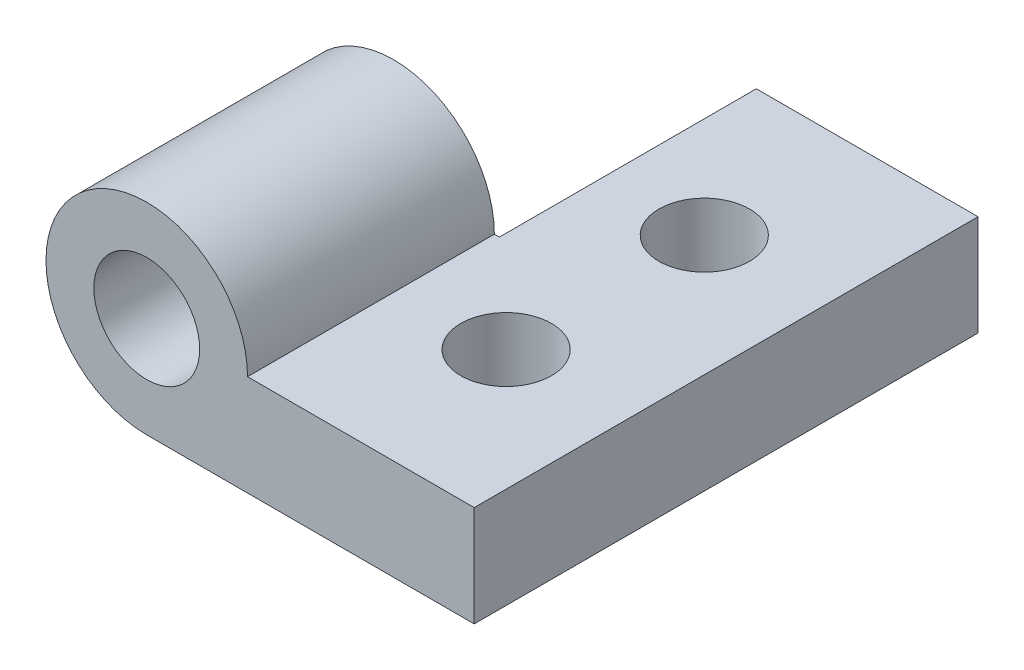
ISO-10303-21;
HEADER;
FILE_DESCRIPTION(('STEP AP214'),'2;1');
FILE_NAME('part.step','',(''),(''),'','','');
FILE_SCHEMA(('AUTOMOTIVE_DESIGN { 1 0 10303 214 1 1 1 1 }'));
ENDSEC;
DATA;
#1=APPLICATION_CONTEXT('core data for automotive mechanical design processes');
#2=APPLICATION_PROTOCOL_DEFINITION('international standard','automotive_design',2000,#1);
#3=PRODUCT_CONTEXT('',#1,'mechanical');
#4=PRODUCT('Part','Part','',(#3));
#5=PRODUCT_RELATED_PRODUCT_CATEGORY('part','',(#4));
#6=PRODUCT_DEFINITION_FORMATION('','',#4);
#7=PRODUCT_DEFINITION_CONTEXT('part definition',#1,'design');
#8=PRODUCT_DEFINITION('design','',#6,#7);
#9=PRODUCT_DEFINITION_SHAPE('','',#8);
#10=(LENGTH_UNIT() NAMED_UNIT(*) SI_UNIT(.MILLI.,.METRE.));
#11=(NAMED_UNIT(*) PLANE_ANGLE_UNIT() SI_UNIT($,.RADIAN.));
#12=(NAMED_UNIT(*) SI_UNIT($,.STERADIAN.) SOLID_ANGLE_UNIT());
#13=UNCERTAINTY_MEASURE_WITH_UNIT(LENGTH_MEASURE(1.E-05),#10,'distance_accuracy_value','');
#14=(GEOMETRIC_REPRESENTATION_CONTEXT(3) GLOBAL_UNCERTAINTY_ASSIGNED_CONTEXT((#13)) GLOBAL_UNIT_ASSIGNED_CONTEXT((#10,
#11,#12)) REPRESENTATION_CONTEXT('',''));
#15=CARTESIAN_POINT('',(0.,0.,0.));
#16=DIRECTION('',(0.,0.,1.));
#17=DIRECTION('',(1.,0.,0.));
#18=AXIS2_PLACEMENT_3D('',#15,#16,#17);
#19=CARTESIAN_POINT('',(-16.51,5.08,25.4));
#20=DIRECTION('',(0.,0.,-1.));
#21=DIRECTION('',(-1.,0.,0.));
#22=AXIS2_PLACEMENT_3D('',#19,#20,#21);
#23=CYLINDRICAL_SURFACE('',#22,5.08);
#24=CARTESIAN_POINT('',(-16.51,5.08,12.954));
#25=DIRECTION('',(0.,0.,-1.));
#26=DIRECTION('',(-1.,0.,0.));
#27=AXIS2_PLACEMENT_3D('',#24,#25,#26);
#28=CIRCLE('',#27,5.08);
#29=CARTESIAN_POINT('',(-16.51,0.,12.954));
#30=VERTEX_POINT('',#29);
#31=CARTESIAN_POINT('',(-11.43,5.08,12.954));
#32=VERTEX_POINT('',#31);
#33=EDGE_CURVE('E104',#30,#32,#28,.T.);
#34=ORIENTED_EDGE('',*,*,#33,.F.);
#35=DIRECTION('',(0.,0.,-1.));
#36=VECTOR('',#35,1.);
#37=CARTESIAN_POINT('',(-16.51,0.,25.4));
#38=LINE('',#37,#36);
#39=CARTESIAN_POINT('',(-16.51,0.,25.4));
#40=VERTEX_POINT('',#39);
#41=EDGE_CURVE('E140',#40,#30,#38,.T.);
#42=ORIENTED_EDGE('',*,*,#41,.F.);
#43=CARTESIAN_POINT('',(-16.51,5.08,25.4));
#44=DIRECTION('',(0.,0.,1.));
#45=DIRECTION('',(1.,0.,0.));
#46=AXIS2_PLACEMENT_3D('',#43,#44,#45);
#47=CIRCLE('',#46,5.08);
#48=CARTESIAN_POINT('',(-11.43,5.08,25.4));
#49=VERTEX_POINT('',#48);
#50=EDGE_CURVE('E129',#49,#40,#47,.T.);
#51=ORIENTED_EDGE('',*,*,#50,.F.);
#52=DIRECTION('',(0.,0.,-1.));
#53=VECTOR('',#52,1.);
#54=CARTESIAN_POINT('',(-11.43,5.08,25.4));
#55=LINE('',#54,#53);
#56=EDGE_CURVE('E143',#49,#32,#55,.T.);
#57=ORIENTED_EDGE('',*,*,#56,.T.);
#58=EDGE_LOOP('',(#34,#42,#51,#57));
#59=FACE_BOUND('',#58,.T.);
#60=ADVANCED_FACE('F36',(#59),#23,.T.);
#61=CARTESIAN_POINT('',(0.,0.,25.4));
#62=DIRECTION('',(-1.,0.,0.));
#63=DIRECTION('',(0.,0.,1.));
#64=AXIS2_PLACEMENT_3D('',#61,#62,#63);
#65=PLANE('',#64);
#66=DIRECTION('',(0.,1.,0.));
#67=VECTOR('',#66,1.);
#68=CARTESIAN_POINT('',(0.,0.,0.));
#69=LINE('',#68,#67);
#70=CARTESIAN_POINT('',(0.,0.,0.));
#71=VERTEX_POINT('',#70);
#72=CARTESIAN_POINT('',(0.,5.08,0.));
#73=VERTEX_POINT('',#72);
#74=EDGE_CURVE('E133',#71,#73,#69,.T.);
#75=ORIENTED_EDGE('',*,*,#74,.T.);
#76=DIRECTION('',(0.,0.,-1.));
#77=VECTOR('',#76,1.);
#78=CARTESIAN_POINT('',(0.,5.08,25.4));
#79=LINE('',#78,#77);
#80=CARTESIAN_POINT('',(0.,5.08,25.4));
#81=VERTEX_POINT('',#80);
#82=EDGE_CURVE('E44',#81,#73,#79,.T.);
#83=ORIENTED_EDGE('',*,*,#82,.F.);
#84=DIRECTION('',(0.,1.,0.));
#85=VECTOR('',#84,1.);
#86=CARTESIAN_POINT('',(0.,0.,25.4));
#87=LINE('',#86,#85);
#88=CARTESIAN_POINT('',(0.,0.,25.4));
#89=VERTEX_POINT('',#88);
#90=EDGE_CURVE('E126',#89,#81,#87,.T.);
#91=ORIENTED_EDGE('',*,*,#90,.F.);
#92=DIRECTION('',(0.,0.,-1.));
#93=VECTOR('',#92,1.);
#94=CARTESIAN_POINT('',(0.,0.,25.4));
#95=LINE('',#94,#93);
#96=EDGE_CURVE('E132',#89,#71,#95,.T.);
#97=ORIENTED_EDGE('',*,*,#96,.T.);
#98=EDGE_LOOP('',(#75,#83,#91,#97));
#99=FACE_BOUND('',#98,.T.);
#100=ADVANCED_FACE('F38',(#99),#65,.F.);
#101=CARTESIAN_POINT('',(0.,5.08,25.4));
#102=DIRECTION('',(0.,-1.,0.));
#103=DIRECTION('',(1.,0.,0.));
#104=AXIS2_PLACEMENT_3D('',#101,#102,#103);
#105=PLANE('',#104);
#106=CARTESIAN_POINT('',(-6.096,5.08,17.6953333333333));
#107=DIRECTION('',(0.,1.,0.));
#108=DIRECTION('',(-1.,0.,0.));
#109=AXIS2_PLACEMENT_3D('',#106,#107,#108);
#110=CIRCLE('',#109,2.286);
#111=CARTESIAN_POINT('',(-8.382,5.08,17.6953333333333));
#112=VERTEX_POINT('',#111);
#113=EDGE_CURVE('E120',#112,#112,#110,.T.);
#114=ORIENTED_EDGE('',*,*,#113,.F.);
#115=EDGE_LOOP('',(#114));
#116=FACE_BOUND('',#115,.T.);
#117=CARTESIAN_POINT('',(-6.096,5.08,7.70466666666667));
#118=DIRECTION('',(0.,1.,0.));
#119=DIRECTION('',(-1.,0.,0.));
#120=AXIS2_PLACEMENT_3D('',#117,#118,#119);
#121=CIRCLE('',#120,2.286);
#122=CARTESIAN_POINT('',(-8.382,5.08,7.70466666666667));
#123=VERTEX_POINT('',#122);
#124=EDGE_CURVE('E106',#123,#123,#121,.T.);
#125=ORIENTED_EDGE('',*,*,#124,.F.);
#126=EDGE_LOOP('',(#125));
#127=FACE_BOUND('',#126,.T.);
#128=DIRECTION('',(-1.,0.,0.));
#129=VECTOR('',#128,1.);
#130=CARTESIAN_POINT('',(0.,5.08,0.));
#131=LINE('',#130,#129);
#132=CARTESIAN_POINT('',(-11.176,5.08,0.));
#133=VERTEX_POINT('',#132);
#134=EDGE_CURVE('E114',#73,#133,#131,.T.);
#135=ORIENTED_EDGE('',*,*,#134,.T.);
#136=DIRECTION('',(0.,0.,-1.));
#137=VECTOR('',#136,1.);
#138=CARTESIAN_POINT('',(-11.176,5.08,12.954));
#139=LINE('',#138,#137);
#140=CARTESIAN_POINT('',(-11.176,5.08,12.954));
#141=VERTEX_POINT('',#140);
#142=EDGE_CURVE('E51',#133,#141,#139,.F.);
#143=ORIENTED_EDGE('',*,*,#142,.T.);
#144=DIRECTION('',(1.,0.,0.));
#145=VECTOR('',#144,1.);
#146=CARTESIAN_POINT('',(0.,5.08,12.954));
#147=LINE('',#146,#145);
#148=EDGE_CURVE('E99',#32,#141,#147,.T.);
#149=ORIENTED_EDGE('',*,*,#148,.F.);
#150=ORIENTED_EDGE('',*,*,#56,.F.);
#151=DIRECTION('',(-1.,0.,0.));
#152=VECTOR('',#151,1.);
#153=CARTESIAN_POINT('',(0.,5.08,25.4));
#154=LINE('',#153,#152);
#155=EDGE_CURVE('E83',#81,#49,#154,.T.);
#156=ORIENTED_EDGE('',*,*,#155,.F.);
#157=ORIENTED_EDGE('',*,*,#82,.T.);
#158=EDGE_LOOP('',(#135,#143,#149,#150,#156,#157));
#159=FACE_BOUND('',#158,.T.);
#160=ADVANCED_FACE('F113',(#116,#127,#159),#105,.F.);
#161=CARTESIAN_POINT('',(0.,0.,25.4));
#162=DIRECTION('',(0.,1.,0.));
#163=DIRECTION('',(-1.,0.,0.));
#164=AXIS2_PLACEMENT_3D('',#161,#162,#163);
#165=PLANE('',#164);
#166=CARTESIAN_POINT('',(-6.096,0.,17.6953333333333));
#167=DIRECTION('',(0.,1.,0.));
#168=DIRECTION('',(-1.,0.,0.));
#169=AXIS2_PLACEMENT_3D('',#166,#167,#168);
#170=CIRCLE('',#169,2.286);
#171=CARTESIAN_POINT('',(-8.382,0.,17.6953333333333));
#172=VERTEX_POINT('',#171);
#173=EDGE_CURVE('E136',#172,#172,#170,.T.);
#174=ORIENTED_EDGE('',*,*,#173,.T.);
#175=EDGE_LOOP('',(#174));
#176=FACE_BOUND('',#175,.T.);
#177=CARTESIAN_POINT('',(-6.096,0.,7.70466666666667));
#178=DIRECTION('',(0.,1.,0.));
#179=DIRECTION('',(-1.,0.,0.));
#180=AXIS2_PLACEMENT_3D('',#177,#178,#179);
#181=CIRCLE('',#180,2.286);
#182=CARTESIAN_POINT('',(-8.382,0.,7.70466666666667));
#183=VERTEX_POINT('',#182);
#184=EDGE_CURVE('E123',#183,#183,#181,.T.);
#185=ORIENTED_EDGE('',*,*,#184,.T.);
#186=EDGE_LOOP('',(#185));
#187=FACE_BOUND('',#186,.T.);
#188=DIRECTION('',(-1.,0.,0.));
#189=VECTOR('',#188,1.);
#190=CARTESIAN_POINT('',(0.,0.,12.954));
#191=LINE('',#190,#189);
#192=CARTESIAN_POINT('',(-14.8836064436921,0.,12.954));
#193=VERTEX_POINT('',#192);
#194=EDGE_CURVE('E11',#193,#30,#191,.T.);
#195=ORIENTED_EDGE('',*,*,#194,.F.);
#196=DIRECTION('',(0.,0.,-1.));
#197=VECTOR('',#196,1.);
#198=CARTESIAN_POINT('',(-14.8836064436921,0.,12.954));
#199=LINE('',#198,#197);
#200=CARTESIAN_POINT('',(-14.8836064436921,0.,0.));
#201=VERTEX_POINT('',#200);
#202=EDGE_CURVE('E109',#193,#201,#199,.T.);
#203=ORIENTED_EDGE('',*,*,#202,.T.);
#204=DIRECTION('',(1.,0.,0.));
#205=VECTOR('',#204,1.);
#206=CARTESIAN_POINT('',(0.,0.,0.));
#207=LINE('',#206,#205);
#208=EDGE_CURVE('E75',#201,#71,#207,.T.);
#209=ORIENTED_EDGE('',*,*,#208,.T.);
#210=ORIENTED_EDGE('',*,*,#96,.F.);
#211=DIRECTION('',(1.,0.,0.));
#212=VECTOR('',#211,1.);
#213=CARTESIAN_POINT('',(0.,0.,25.4));
#214=LINE('',#213,#212);
#215=EDGE_CURVE('E60',#40,#89,#214,.T.);
#216=ORIENTED_EDGE('',*,*,#215,.F.);
#217=ORIENTED_EDGE('',*,*,#41,.T.);
#218=EDGE_LOOP('',(#195,#203,#209,#210,#216,#217));
#219=FACE_BOUND('',#218,.T.);
#220=ADVANCED_FACE('F150',(#176,#187,#219),#165,.F.);
#221=CARTESIAN_POINT('',(-16.51,5.08,25.4));
#222=DIRECTION('',(0.,0.,1.));
#223=DIRECTION('',(1.,0.,0.));
#224=AXIS2_PLACEMENT_3D('',#221,#222,#223);
#225=PLANE('',#224);
#226=CARTESIAN_POINT('',(-16.51,5.08,25.4));
#227=DIRECTION('',(0.,0.,1.));
#228=DIRECTION('',(1.,0.,0.));
#229=AXIS2_PLACEMENT_3D('',#226,#227,#228);
#230=CIRCLE('',#229,2.667);
#231=CARTESIAN_POINT('',(-13.843,5.08,25.4));
#232=VERTEX_POINT('',#231);
#233=EDGE_CURVE('E194',#232,#232,#230,.T.);
#234=ORIENTED_EDGE('',*,*,#233,.F.);
#235=EDGE_LOOP('',(#234));
#236=FACE_BOUND('',#235,.T.);
#237=ORIENTED_EDGE('',*,*,#90,.T.);
#238=ORIENTED_EDGE('',*,*,#155,.T.);
#239=ORIENTED_EDGE('',*,*,#50,.T.);
#240=ORIENTED_EDGE('',*,*,#215,.T.);
#241=EDGE_LOOP('',(#237,#238,#239,#240));
#242=FACE_BOUND('',#241,.T.);
#243=ADVANCED_FACE('F182',(#236,#242),#225,.T.);
#244=CARTESIAN_POINT('',(-16.51,5.08,0.));
#245=DIRECTION('',(0.,0.,1.));
#246=DIRECTION('',(1.,0.,0.));
#247=AXIS2_PLACEMENT_3D('',#244,#245,#246);
#248=PLANE('',#247);
#249=ORIENTED_EDGE('',*,*,#208,.F.);
#250=CARTESIAN_POINT('',(-16.51,5.08,0.));
#251=DIRECTION('',(0.,0.,-1.));
#252=DIRECTION('',(-1.,0.,0.));
#253=AXIS2_PLACEMENT_3D('',#250,#251,#252);
#254=CIRCLE('',#253,5.334);
#255=EDGE_CURVE('E110',#133,#201,#254,.T.);
#256=ORIENTED_EDGE('',*,*,#255,.F.);
#257=ORIENTED_EDGE('',*,*,#134,.F.);
#258=ORIENTED_EDGE('',*,*,#74,.F.);
#259=EDGE_LOOP('',(#249,#256,#257,#258));
#260=FACE_BOUND('',#259,.T.);
#261=ADVANCED_FACE('F164',(#260),#248,.F.);
#262=CARTESIAN_POINT('',(-6.096,-7.874,7.70466666666667));
#263=DIRECTION('',(0.,1.,0.));
#264=DIRECTION('',(-1.,0.,0.));
#265=AXIS2_PLACEMENT_3D('',#262,#263,#264);
#266=CYLINDRICAL_SURFACE('',#265,2.286);
#267=ORIENTED_EDGE('',*,*,#124,.T.);
#268=EDGE_LOOP('',(#267));
#269=FACE_BOUND('',#268,.T.);
#270=ORIENTED_EDGE('',*,*,#184,.F.);
#271=EDGE_LOOP('',(#270));
#272=FACE_BOUND('',#271,.T.);
#273=ADVANCED_FACE('F155',(#269,#272),#266,.F.);
#274=CARTESIAN_POINT('',(-6.096,-7.874,17.6953333333333));
#275=DIRECTION('',(0.,1.,0.));
#276=DIRECTION('',(-1.,0.,0.));
#277=AXIS2_PLACEMENT_3D('',#274,#275,#276);
#278=CYLINDRICAL_SURFACE('',#277,2.286);
#279=ORIENTED_EDGE('',*,*,#113,.T.);
#280=EDGE_LOOP('',(#279));
#281=FACE_BOUND('',#280,.T.);
#282=ORIENTED_EDGE('',*,*,#173,.F.);
#283=EDGE_LOOP('',(#282));
#284=FACE_BOUND('',#283,.T.);
#285=ADVANCED_FACE('F153',(#281,#284),#278,.F.);
#286=CARTESIAN_POINT('',(-16.51,5.08,12.954));
#287=DIRECTION('',(0.,0.,-1.));
#288=DIRECTION('',(-1.,0.,0.));
#289=AXIS2_PLACEMENT_3D('',#286,#287,#288);
#290=PLANE('',#289);
#291=CARTESIAN_POINT('',(-16.51,5.08,12.954));
#292=DIRECTION('',(0.,0.,-1.));
#293=DIRECTION('',(-1.,0.,0.));
#294=AXIS2_PLACEMENT_3D('',#291,#292,#293);
#295=CIRCLE('',#294,2.667);
#296=CARTESIAN_POINT('',(-19.177,5.08,12.954));
#297=VERTEX_POINT('',#296);
#298=EDGE_CURVE('E196',#297,#297,#295,.T.);
#299=ORIENTED_EDGE('',*,*,#298,.F.);
#300=EDGE_LOOP('',(#299));
#301=FACE_BOUND('',#300,.T.);
#302=ORIENTED_EDGE('',*,*,#148,.T.);
#303=CARTESIAN_POINT('',(-16.51,5.08,12.954));
#304=DIRECTION('',(0.,0.,-1.));
#305=DIRECTION('',(-1.,0.,0.));
#306=AXIS2_PLACEMENT_3D('',#303,#304,#305);
#307=CIRCLE('',#306,5.334);
#308=EDGE_CURVE('E101',#141,#193,#307,.T.);
#309=ORIENTED_EDGE('',*,*,#308,.T.);
#310=ORIENTED_EDGE('',*,*,#194,.T.);
#311=ORIENTED_EDGE('',*,*,#33,.T.);
#312=EDGE_LOOP('',(#302,#309,#310,#311));
#313=FACE_BOUND('',#312,.T.);
#314=ADVANCED_FACE('F100',(#301,#313),#290,.T.);
#315=CARTESIAN_POINT('',(-16.51,5.08,12.954));
#316=DIRECTION('',(0.,0.,-1.));
#317=DIRECTION('',(-1.,0.,0.));
#318=AXIS2_PLACEMENT_3D('',#315,#316,#317);
#319=CYLINDRICAL_SURFACE('',#318,5.334);
#320=ORIENTED_EDGE('',*,*,#255,.T.);
#321=ORIENTED_EDGE('',*,*,#202,.F.);
#322=ORIENTED_EDGE('',*,*,#308,.F.);
#323=ORIENTED_EDGE('',*,*,#142,.F.);
#324=EDGE_LOOP('',(#320,#321,#322,#323));
#325=FACE_BOUND('',#324,.T.);
#326=ADVANCED_FACE('F108',(#325),#319,.F.);
#327=CARTESIAN_POINT('',(-16.51,5.08,25.654));
#328=DIRECTION('',(0.,0.,-1.));
#329=DIRECTION('',(-1.,0.,0.));
#330=AXIS2_PLACEMENT_3D('',#327,#328,#329);
#331=CYLINDRICAL_SURFACE('',#330,2.667);
#332=ORIENTED_EDGE('',*,*,#233,.T.);
#333=EDGE_LOOP('',(#332));
#334=FACE_BOUND('',#333,.T.);
#335=ORIENTED_EDGE('',*,*,#298,.T.);
#336=EDGE_LOOP('',(#335));
#337=FACE_BOUND('',#336,.T.);
#338=ADVANCED_FACE('F202',(#334,#337),#331,.F.);
#339=CLOSED_SHELL('',(#60,#100,#160,#220,#243,#261,#273,#285,#314,#326,#338));
#340=MANIFOLD_SOLID_BREP('B2',#339);
#341=ADVANCED_BREP_SHAPE_REPRESENTATION('',(#18,#340),#14);
#342=SHAPE_DEFINITION_REPRESENTATION(#9,#341);
ENDSEC;
END-ISO-10303-21;
